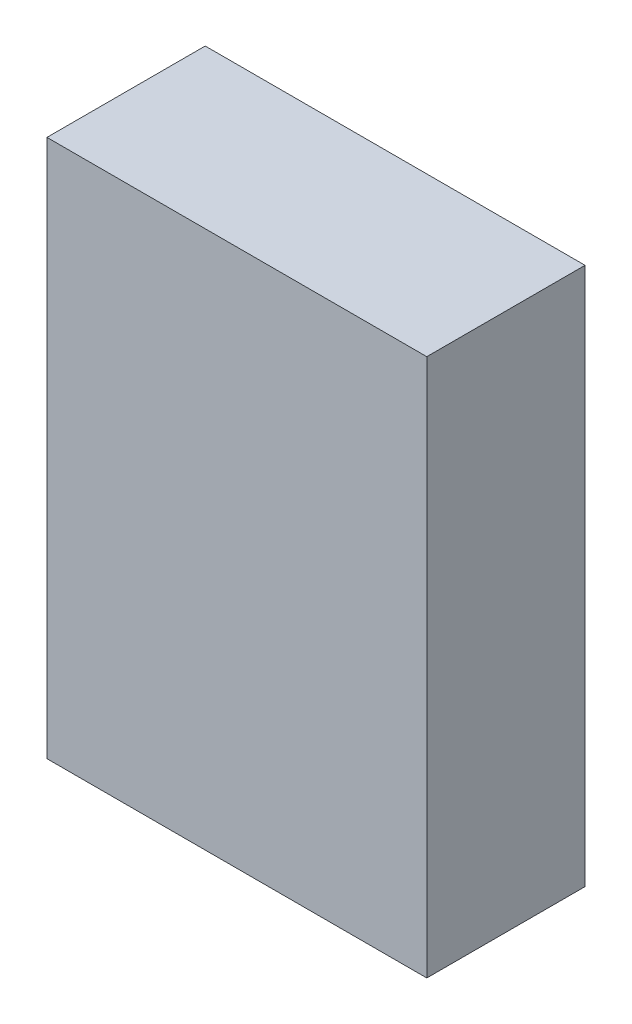
ISO-10303-21;
HEADER;
FILE_DESCRIPTION(('STEP AP214'),'2;1');
FILE_NAME('part.step','',(''),(''),'','','');
FILE_SCHEMA(('AUTOMOTIVE_DESIGN { 1 0 10303 214 1 1 1 1 }'));
ENDSEC;
DATA;
#1=APPLICATION_CONTEXT('core data for automotive mechanical design processes');
#2=APPLICATION_PROTOCOL_DEFINITION('international standard','automotive_design',2000,#1);
#3=PRODUCT_CONTEXT('',#1,'mechanical');
#4=PRODUCT('Part','Part','',(#3));
#5=PRODUCT_RELATED_PRODUCT_CATEGORY('part','',(#4));
#6=PRODUCT_DEFINITION_FORMATION('','',#4);
#7=PRODUCT_DEFINITION_CONTEXT('part definition',#1,'design');
#8=PRODUCT_DEFINITION('design','',#6,#7);
#9=PRODUCT_DEFINITION_SHAPE('','',#8);
#10=(LENGTH_UNIT() NAMED_UNIT(*) SI_UNIT(.MILLI.,.METRE.));
#11=(NAMED_UNIT(*) PLANE_ANGLE_UNIT() SI_UNIT($,.RADIAN.));
#12=(NAMED_UNIT(*) SI_UNIT($,.STERADIAN.) SOLID_ANGLE_UNIT());
#13=UNCERTAINTY_MEASURE_WITH_UNIT(LENGTH_MEASURE(1.E-05),#10,'distance_accuracy_value','');
#14=(GEOMETRIC_REPRESENTATION_CONTEXT(3) GLOBAL_UNCERTAINTY_ASSIGNED_CONTEXT((#13)) GLOBAL_UNIT_ASSIGNED_CONTEXT((#10,
#11,#12)) REPRESENTATION_CONTEXT('',''));
#15=CARTESIAN_POINT('',(0.,0.,0.));
#16=DIRECTION('',(0.,0.,1.));
#17=DIRECTION('',(1.,0.,0.));
#18=AXIS2_PLACEMENT_3D('',#15,#16,#17);
#19=CARTESIAN_POINT('',(-2.37,2.58,0.));
#20=DIRECTION('',(1.,0.,0.));
#21=DIRECTION('',(0.,0.,1.));
#22=AXIS2_PLACEMENT_3D('',#19,#20,#21);
#23=PLANE('',#22);
#24=DIRECTION('',(0.,1.,0.));
#25=VECTOR('',#24,1.);
#26=CARTESIAN_POINT('',(-2.37,2.58,0.1));
#27=LINE('',#26,#25);
#28=CARTESIAN_POINT('',(-2.37,2.58,0.1));
#29=VERTEX_POINT('',#28);
#30=CARTESIAN_POINT('',(-2.37,2.92,0.1));
#31=VERTEX_POINT('',#30);
#32=EDGE_CURVE('E11',#29,#31,#27,.T.);
#33=ORIENTED_EDGE('',*,*,#32,.T.);
#34=DIRECTION('',(0.,0.,1.));
#35=VECTOR('',#34,1.);
#36=CARTESIAN_POINT('',(-2.37,2.92,0.));
#37=LINE('',#36,#35);
#38=CARTESIAN_POINT('',(-2.37,2.92,0.));
#39=VERTEX_POINT('',#38);
#40=EDGE_CURVE('E24',#39,#31,#37,.T.);
#41=ORIENTED_EDGE('',*,*,#40,.F.);
#42=DIRECTION('',(0.,1.,0.));
#43=VECTOR('',#42,1.);
#44=CARTESIAN_POINT('',(-2.37,2.58,0.));
#45=LINE('',#44,#43);
#46=CARTESIAN_POINT('',(-2.37,2.58,0.));
#47=VERTEX_POINT('',#46);
#48=EDGE_CURVE('E86',#47,#39,#45,.T.);
#49=ORIENTED_EDGE('',*,*,#48,.F.);
#50=DIRECTION('',(0.,0.,1.));
#51=VECTOR('',#50,1.);
#52=CARTESIAN_POINT('',(-2.37,2.58,0.));
#53=LINE('',#52,#51);
#54=EDGE_CURVE('E36',#47,#29,#53,.T.);
#55=ORIENTED_EDGE('',*,*,#54,.T.);
#56=EDGE_LOOP('',(#33,#41,#49,#55));
#57=FACE_BOUND('',#56,.T.);
#58=ADVANCED_FACE('F17',(#57),#23,.F.);
#59=CARTESIAN_POINT('',(-2.13,2.58,0.));
#60=DIRECTION('',(1.,0.,0.));
#61=DIRECTION('',(0.,0.,1.));
#62=AXIS2_PLACEMENT_3D('',#59,#60,#61);
#63=PLANE('',#62);
#64=DIRECTION('',(0.,0.,1.));
#65=VECTOR('',#64,1.);
#66=CARTESIAN_POINT('',(-2.13,2.58,0.));
#67=LINE('',#66,#65);
#68=CARTESIAN_POINT('',(-2.13,2.58,0.));
#69=VERTEX_POINT('',#68);
#70=CARTESIAN_POINT('',(-2.13,2.58,0.1));
#71=VERTEX_POINT('',#70);
#72=EDGE_CURVE('E83',#69,#71,#67,.T.);
#73=ORIENTED_EDGE('',*,*,#72,.F.);
#74=DIRECTION('',(0.,1.,0.));
#75=VECTOR('',#74,1.);
#76=CARTESIAN_POINT('',(-2.13,2.58,0.));
#77=LINE('',#76,#75);
#78=CARTESIAN_POINT('',(-2.13,2.92,0.));
#79=VERTEX_POINT('',#78);
#80=EDGE_CURVE('E63',#69,#79,#77,.T.);
#81=ORIENTED_EDGE('',*,*,#80,.T.);
#82=DIRECTION('',(0.,0.,1.));
#83=VECTOR('',#82,1.);
#84=CARTESIAN_POINT('',(-2.13,2.92,0.));
#85=LINE('',#84,#83);
#86=CARTESIAN_POINT('',(-2.13,2.92,0.1));
#87=VERTEX_POINT('',#86);
#88=EDGE_CURVE('E57',#79,#87,#85,.T.);
#89=ORIENTED_EDGE('',*,*,#88,.T.);
#90=DIRECTION('',(0.,1.,0.));
#91=VECTOR('',#90,1.);
#92=CARTESIAN_POINT('',(-2.13,2.58,0.1));
#93=LINE('',#92,#91);
#94=EDGE_CURVE('E60',#71,#87,#93,.T.);
#95=ORIENTED_EDGE('',*,*,#94,.F.);
#96=EDGE_LOOP('',(#73,#81,#89,#95));
#97=FACE_BOUND('',#96,.T.);
#98=ADVANCED_FACE('F59',(#97),#63,.T.);
#99=CARTESIAN_POINT('',(-2.37,2.58,0.));
#100=DIRECTION('',(0.,1.,0.));
#101=DIRECTION('',(0.,0.,1.));
#102=AXIS2_PLACEMENT_3D('',#99,#100,#101);
#103=PLANE('',#102);
#104=ORIENTED_EDGE('',*,*,#72,.T.);
#105=DIRECTION('',(1.,0.,0.));
#106=VECTOR('',#105,1.);
#107=CARTESIAN_POINT('',(-2.37,2.58,0.1));
#108=LINE('',#107,#106);
#109=EDGE_CURVE('E71',#29,#71,#108,.T.);
#110=ORIENTED_EDGE('',*,*,#109,.F.);
#111=ORIENTED_EDGE('',*,*,#54,.F.);
#112=DIRECTION('',(1.,0.,0.));
#113=VECTOR('',#112,1.);
#114=CARTESIAN_POINT('',(-2.37,2.58,0.));
#115=LINE('',#114,#113);
#116=EDGE_CURVE('E76',#47,#69,#115,.T.);
#117=ORIENTED_EDGE('',*,*,#116,.T.);
#118=EDGE_LOOP('',(#104,#110,#111,#117));
#119=FACE_BOUND('',#118,.T.);
#120=ADVANCED_FACE('F91',(#119),#103,.F.);
#121=CARTESIAN_POINT('',(-2.37,2.92,0.));
#122=DIRECTION('',(0.,1.,0.));
#123=DIRECTION('',(0.,0.,1.));
#124=AXIS2_PLACEMENT_3D('',#121,#122,#123);
#125=PLANE('',#124);
#126=DIRECTION('',(1.,0.,0.));
#127=VECTOR('',#126,1.);
#128=CARTESIAN_POINT('',(-2.37,2.92,0.));
#129=LINE('',#128,#127);
#130=EDGE_CURVE('E74',#39,#79,#129,.T.);
#131=ORIENTED_EDGE('',*,*,#130,.F.);
#132=ORIENTED_EDGE('',*,*,#40,.T.);
#133=DIRECTION('',(1.,0.,0.));
#134=VECTOR('',#133,1.);
#135=CARTESIAN_POINT('',(-2.37,2.92,0.1));
#136=LINE('',#135,#134);
#137=EDGE_CURVE('E69',#31,#87,#136,.T.);
#138=ORIENTED_EDGE('',*,*,#137,.T.);
#139=ORIENTED_EDGE('',*,*,#88,.F.);
#140=EDGE_LOOP('',(#131,#132,#138,#139));
#141=FACE_BOUND('',#140,.T.);
#142=ADVANCED_FACE('F73',(#141),#125,.T.);
#143=CARTESIAN_POINT('',(-2.37,2.58,0.));
#144=DIRECTION('',(0.,0.,1.));
#145=DIRECTION('',(1.,0.,0.));
#146=AXIS2_PLACEMENT_3D('',#143,#144,#145);
#147=PLANE('',#146);
#148=ORIENTED_EDGE('',*,*,#130,.T.);
#149=ORIENTED_EDGE('',*,*,#80,.F.);
#150=ORIENTED_EDGE('',*,*,#116,.F.);
#151=ORIENTED_EDGE('',*,*,#48,.T.);
#152=EDGE_LOOP('',(#148,#149,#150,#151));
#153=FACE_BOUND('',#152,.T.);
#154=ADVANCED_FACE('F89',(#153),#147,.F.);
#155=CARTESIAN_POINT('',(-2.37,2.58,0.1));
#156=DIRECTION('',(0.,0.,1.));
#157=DIRECTION('',(1.,0.,0.));
#158=AXIS2_PLACEMENT_3D('',#155,#156,#157);
#159=PLANE('',#158);
#160=ORIENTED_EDGE('',*,*,#32,.F.);
#161=ORIENTED_EDGE('',*,*,#109,.T.);
#162=ORIENTED_EDGE('',*,*,#94,.T.);
#163=ORIENTED_EDGE('',*,*,#137,.F.);
#164=EDGE_LOOP('',(#160,#161,#162,#163));
#165=FACE_BOUND('',#164,.T.);
#166=ADVANCED_FACE('F68',(#165),#159,.T.);
#167=CLOSED_SHELL('',(#58,#98,#120,#142,#154,#166));
#168=MANIFOLD_SOLID_BREP('B1',#167);
#169=ADVANCED_BREP_SHAPE_REPRESENTATION('',(#18,#168),#14);
#170=SHAPE_DEFINITION_REPRESENTATION(#9,#169);
ENDSEC;
END-ISO-10303-21;
